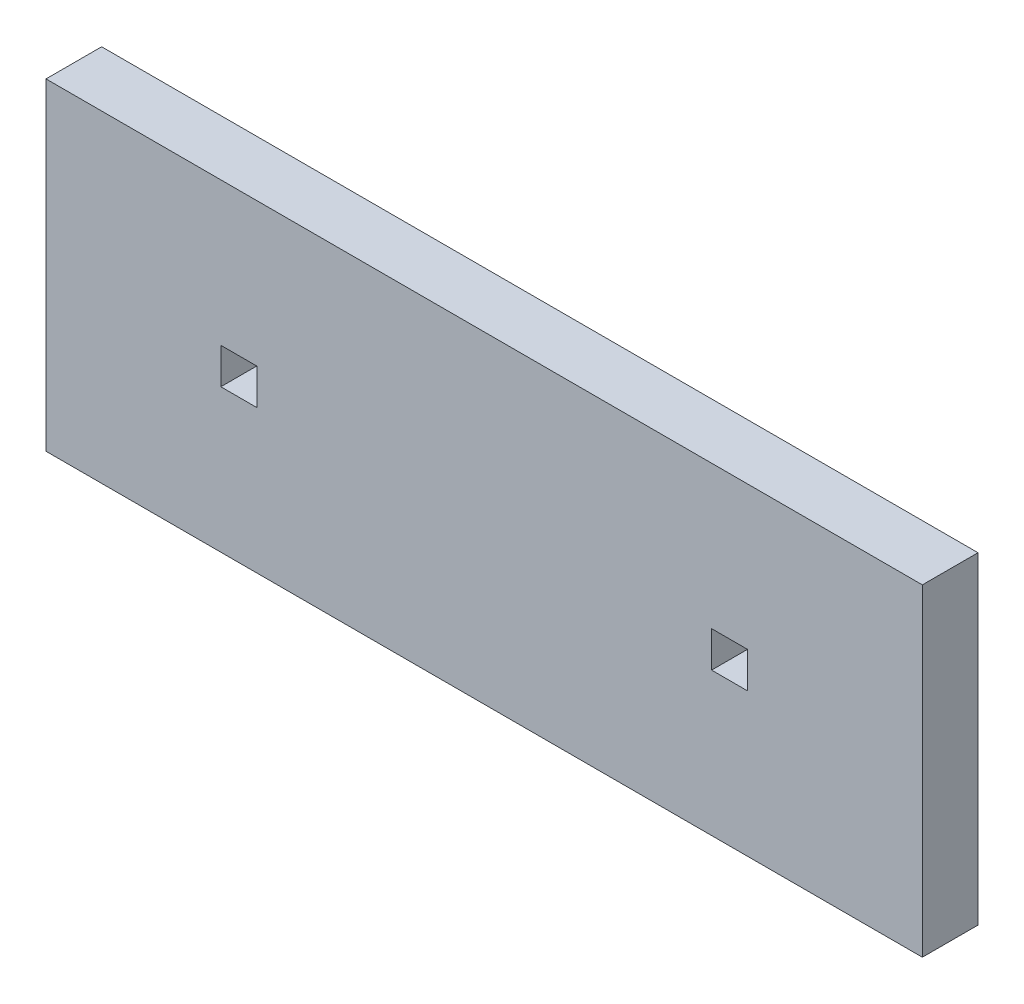
ISO-10303-21;
HEADER;
FILE_DESCRIPTION(('STEP AP214'),'2;1');
FILE_NAME('part.step','',(''),(''),'','','');
FILE_SCHEMA(('AUTOMOTIVE_DESIGN { 1 0 10303 214 1 1 1 1 }'));
ENDSEC;
DATA;
#1=APPLICATION_CONTEXT('core data for automotive mechanical design processes');
#2=APPLICATION_PROTOCOL_DEFINITION('international standard','automotive_design',2000,#1);
#3=PRODUCT_CONTEXT('',#1,'mechanical');
#4=PRODUCT('Part','Part','',(#3));
#5=PRODUCT_RELATED_PRODUCT_CATEGORY('part','',(#4));
#6=PRODUCT_DEFINITION_FORMATION('','',#4);
#7=PRODUCT_DEFINITION_CONTEXT('part definition',#1,'design');
#8=PRODUCT_DEFINITION('design','',#6,#7);
#9=PRODUCT_DEFINITION_SHAPE('','',#8);
#10=(LENGTH_UNIT() NAMED_UNIT(*) SI_UNIT(.MILLI.,.METRE.));
#11=(NAMED_UNIT(*) PLANE_ANGLE_UNIT() SI_UNIT($,.RADIAN.));
#12=(NAMED_UNIT(*) SI_UNIT($,.STERADIAN.) SOLID_ANGLE_UNIT());
#13=UNCERTAINTY_MEASURE_WITH_UNIT(LENGTH_MEASURE(1.E-05),#10,'distance_accuracy_value','');
#14=(GEOMETRIC_REPRESENTATION_CONTEXT(3) GLOBAL_UNCERTAINTY_ASSIGNED_CONTEXT((#13)) GLOBAL_UNIT_ASSIGNED_CONTEXT((#10,
#11,#12)) REPRESENTATION_CONTEXT('',''));
#15=CARTESIAN_POINT('',(0.,0.,0.));
#16=DIRECTION('',(0.,0.,1.));
#17=DIRECTION('',(1.,0.,0.));
#18=AXIS2_PLACEMENT_3D('',#15,#16,#17);
#19=CARTESIAN_POINT('',(0.,-2.61249429999999,3.175));
#20=DIRECTION('',(0.,-1.,0.));
#21=DIRECTION('',(0.,0.,-1.));
#22=AXIS2_PLACEMENT_3D('',#19,#20,#21);
#23=PLANE('',#22);
#24=DIRECTION('',(-1.,0.,0.));
#25=VECTOR('',#24,1.);
#26=CARTESIAN_POINT('',(0.,-2.61249429999999,0.));
#27=LINE('',#26,#25);
#28=CARTESIAN_POINT('',(15.025,-2.61249429999999,0.));
#29=VERTEX_POINT('',#28);
#30=CARTESIAN_POINT('',(12.975,-2.61249429999999,0.));
#31=VERTEX_POINT('',#30);
#32=EDGE_CURVE('E180',#29,#31,#27,.T.);
#33=ORIENTED_EDGE('',*,*,#32,.T.);
#34=DIRECTION('',(0.,0.,-1.));
#35=VECTOR('',#34,1.);
#36=CARTESIAN_POINT('',(12.975,-2.61249429999999,3.175));
#37=LINE('',#36,#35);
#38=CARTESIAN_POINT('',(12.975,-2.61249429999999,3.175));
#39=VERTEX_POINT('',#38);
#40=EDGE_CURVE('E11',#39,#31,#37,.T.);
#41=ORIENTED_EDGE('',*,*,#40,.F.);
#42=DIRECTION('',(-1.,0.,0.));
#43=VECTOR('',#42,1.);
#44=CARTESIAN_POINT('',(0.,-2.61249429999999,3.175));
#45=LINE('',#44,#43);
#46=CARTESIAN_POINT('',(15.025,-2.61249429999999,3.175));
#47=VERTEX_POINT('',#46);
#48=EDGE_CURVE('E139',#47,#39,#45,.T.);
#49=ORIENTED_EDGE('',*,*,#48,.F.);
#50=DIRECTION('',(0.,0.,-1.));
#51=VECTOR('',#50,1.);
#52=CARTESIAN_POINT('',(15.025,-2.61249429999999,3.175));
#53=LINE('',#52,#51);
#54=EDGE_CURVE('E55',#47,#29,#53,.T.);
#55=ORIENTED_EDGE('',*,*,#54,.T.);
#56=EDGE_LOOP('',(#33,#41,#49,#55));
#57=FACE_BOUND('',#56,.T.);
#58=ADVANCED_FACE('F36',(#57),#23,.F.);
#59=CARTESIAN_POINT('',(12.975,0.,3.175));
#60=DIRECTION('',(-1.,0.,0.));
#61=DIRECTION('',(0.,-1.,0.));
#62=AXIS2_PLACEMENT_3D('',#59,#60,#61);
#63=PLANE('',#62);
#64=DIRECTION('',(0.,1.,0.));
#65=VECTOR('',#64,1.);
#66=CARTESIAN_POINT('',(12.975,0.,0.));
#67=LINE('',#66,#65);
#68=CARTESIAN_POINT('',(12.975,-0.562494299999992,0.));
#69=VERTEX_POINT('',#68);
#70=EDGE_CURVE('E145',#31,#69,#67,.T.);
#71=ORIENTED_EDGE('',*,*,#70,.T.);
#72=DIRECTION('',(0.,0.,-1.));
#73=VECTOR('',#72,1.);
#74=CARTESIAN_POINT('',(12.975,-0.562494299999992,3.175));
#75=LINE('',#74,#73);
#76=CARTESIAN_POINT('',(12.975,-0.562494299999992,3.175));
#77=VERTEX_POINT('',#76);
#78=EDGE_CURVE('E46',#77,#69,#75,.T.);
#79=ORIENTED_EDGE('',*,*,#78,.F.);
#80=DIRECTION('',(0.,1.,0.));
#81=VECTOR('',#80,1.);
#82=CARTESIAN_POINT('',(12.975,0.,3.175));
#83=LINE('',#82,#81);
#84=EDGE_CURVE('E133',#39,#77,#83,.T.);
#85=ORIENTED_EDGE('',*,*,#84,.F.);
#86=ORIENTED_EDGE('',*,*,#40,.T.);
#87=EDGE_LOOP('',(#71,#79,#85,#86));
#88=FACE_BOUND('',#87,.T.);
#89=ADVANCED_FACE('F144',(#88),#63,.F.);
#90=CARTESIAN_POINT('',(0.,-0.562494299999991,3.175));
#91=DIRECTION('',(0.,-1.,0.));
#92=DIRECTION('',(1.,0.,0.));
#93=AXIS2_PLACEMENT_3D('',#90,#91,#92);
#94=PLANE('',#93);
#95=DIRECTION('',(-1.,0.,0.));
#96=VECTOR('',#95,1.);
#97=CARTESIAN_POINT('',(0.,-0.562494299999991,0.));
#98=LINE('',#97,#96);
#99=CARTESIAN_POINT('',(15.025,-0.562494299999992,0.));
#100=VERTEX_POINT('',#99);
#101=EDGE_CURVE('E183',#100,#69,#98,.T.);
#102=ORIENTED_EDGE('',*,*,#101,.F.);
#103=DIRECTION('',(0.,0.,-1.));
#104=VECTOR('',#103,1.);
#105=CARTESIAN_POINT('',(15.025,-0.562494299999992,3.175));
#106=LINE('',#105,#104);
#107=CARTESIAN_POINT('',(15.025,-0.562494299999992,3.175));
#108=VERTEX_POINT('',#107);
#109=EDGE_CURVE('E93',#108,#100,#106,.T.);
#110=ORIENTED_EDGE('',*,*,#109,.F.);
#111=DIRECTION('',(-1.,0.,0.));
#112=VECTOR('',#111,1.);
#113=CARTESIAN_POINT('',(0.,-0.562494299999991,3.175));
#114=LINE('',#113,#112);
#115=EDGE_CURVE('E138',#108,#77,#114,.T.);
#116=ORIENTED_EDGE('',*,*,#115,.T.);
#117=ORIENTED_EDGE('',*,*,#78,.T.);
#118=EDGE_LOOP('',(#102,#110,#116,#117));
#119=FACE_BOUND('',#118,.T.);
#120=ADVANCED_FACE('F149',(#119),#94,.T.);
#121=CARTESIAN_POINT('',(0.,-0.562494299999992,3.175));
#122=DIRECTION('',(0.,1.,0.));
#123=DIRECTION('',(0.,0.,1.));
#124=AXIS2_PLACEMENT_3D('',#121,#122,#123);
#125=PLANE('',#124);
#126=DIRECTION('',(1.,0.,0.));
#127=VECTOR('',#126,1.);
#128=CARTESIAN_POINT('',(0.,-0.562494299999992,0.));
#129=LINE('',#128,#127);
#130=CARTESIAN_POINT('',(-15.025,-0.562494299999992,0.));
#131=VERTEX_POINT('',#130);
#132=CARTESIAN_POINT('',(-12.975,-0.562494299999992,0.));
#133=VERTEX_POINT('',#132);
#134=EDGE_CURVE('E168',#131,#133,#129,.T.);
#135=ORIENTED_EDGE('',*,*,#134,.T.);
#136=DIRECTION('',(0.,0.,-1.));
#137=VECTOR('',#136,1.);
#138=CARTESIAN_POINT('',(-12.975,-0.562494299999992,3.175));
#139=LINE('',#138,#137);
#140=CARTESIAN_POINT('',(-12.975,-0.562494299999992,3.175));
#141=VERTEX_POINT('',#140);
#142=EDGE_CURVE('E190',#141,#133,#139,.T.);
#143=ORIENTED_EDGE('',*,*,#142,.F.);
#144=DIRECTION('',(1.,0.,0.));
#145=VECTOR('',#144,1.);
#146=CARTESIAN_POINT('',(0.,-0.562494299999992,3.175));
#147=LINE('',#146,#145);
#148=CARTESIAN_POINT('',(-15.025,-0.562494299999992,3.175));
#149=VERTEX_POINT('',#148);
#150=EDGE_CURVE('E225',#149,#141,#147,.T.);
#151=ORIENTED_EDGE('',*,*,#150,.F.);
#152=DIRECTION('',(0.,0.,-1.));
#153=VECTOR('',#152,1.);
#154=CARTESIAN_POINT('',(-15.025,-0.562494299999992,3.175));
#155=LINE('',#154,#153);
#156=EDGE_CURVE('E192',#149,#131,#155,.T.);
#157=ORIENTED_EDGE('',*,*,#156,.T.);
#158=EDGE_LOOP('',(#135,#143,#151,#157));
#159=FACE_BOUND('',#158,.T.);
#160=ADVANCED_FACE('F255',(#159),#125,.F.);
#161=CARTESIAN_POINT('',(-12.975,0.,3.175));
#162=DIRECTION('',(1.,0.,0.));
#163=DIRECTION('',(0.,1.,0.));
#164=AXIS2_PLACEMENT_3D('',#161,#162,#163);
#165=PLANE('',#164);
#166=DIRECTION('',(0.,-1.,0.));
#167=VECTOR('',#166,1.);
#168=CARTESIAN_POINT('',(-12.975,0.,0.));
#169=LINE('',#168,#167);
#170=CARTESIAN_POINT('',(-12.975,-2.61249429999999,0.));
#171=VERTEX_POINT('',#170);
#172=EDGE_CURVE('E171',#133,#171,#169,.T.);
#173=ORIENTED_EDGE('',*,*,#172,.T.);
#174=DIRECTION('',(0.,0.,-1.));
#175=VECTOR('',#174,1.);
#176=CARTESIAN_POINT('',(-12.975,-2.61249429999999,3.175));
#177=LINE('',#176,#175);
#178=CARTESIAN_POINT('',(-12.975,-2.61249429999999,3.175));
#179=VERTEX_POINT('',#178);
#180=EDGE_CURVE('E196',#179,#171,#177,.T.);
#181=ORIENTED_EDGE('',*,*,#180,.F.);
#182=DIRECTION('',(0.,-1.,0.));
#183=VECTOR('',#182,1.);
#184=CARTESIAN_POINT('',(-12.975,0.,3.175));
#185=LINE('',#184,#183);
#186=EDGE_CURVE('E234',#141,#179,#185,.T.);
#187=ORIENTED_EDGE('',*,*,#186,.F.);
#188=ORIENTED_EDGE('',*,*,#142,.T.);
#189=EDGE_LOOP('',(#173,#181,#187,#188));
#190=FACE_BOUND('',#189,.T.);
#191=ADVANCED_FACE('F257',(#190),#165,.F.);
#192=CARTESIAN_POINT('',(0.,-2.61249429999999,3.175));
#193=DIRECTION('',(0.,1.,0.));
#194=DIRECTION('',(0.,0.,1.));
#195=AXIS2_PLACEMENT_3D('',#192,#193,#194);
#196=PLANE('',#195);
#197=DIRECTION('',(1.,0.,0.));
#198=VECTOR('',#197,1.);
#199=CARTESIAN_POINT('',(0.,-2.61249429999999,0.));
#200=LINE('',#199,#198);
#201=CARTESIAN_POINT('',(-15.025,-2.61249429999999,0.));
#202=VERTEX_POINT('',#201);
#203=EDGE_CURVE('E174',#202,#171,#200,.T.);
#204=ORIENTED_EDGE('',*,*,#203,.F.);
#205=DIRECTION('',(0.,0.,-1.));
#206=VECTOR('',#205,1.);
#207=CARTESIAN_POINT('',(-15.025,-2.61249429999999,3.175));
#208=LINE('',#207,#206);
#209=CARTESIAN_POINT('',(-15.025,-2.61249429999999,3.175));
#210=VERTEX_POINT('',#209);
#211=EDGE_CURVE('E194',#210,#202,#208,.T.);
#212=ORIENTED_EDGE('',*,*,#211,.F.);
#213=DIRECTION('',(1.,0.,0.));
#214=VECTOR('',#213,1.);
#215=CARTESIAN_POINT('',(0.,-2.61249429999999,3.175));
#216=LINE('',#215,#214);
#217=EDGE_CURVE('E236',#210,#179,#216,.T.);
#218=ORIENTED_EDGE('',*,*,#217,.T.);
#219=ORIENTED_EDGE('',*,*,#180,.T.);
#220=EDGE_LOOP('',(#204,#212,#218,#219));
#221=FACE_BOUND('',#220,.T.);
#222=ADVANCED_FACE('F251',(#221),#196,.T.);
#223=CARTESIAN_POINT('',(0.,7.6124943,3.175));
#224=DIRECTION('',(0.,1.,0.));
#225=DIRECTION('',(0.,0.,1.));
#226=AXIS2_PLACEMENT_3D('',#223,#224,#225);
#227=PLANE('',#226);
#228=DIRECTION('',(1.,0.,0.));
#229=VECTOR('',#228,1.);
#230=CARTESIAN_POINT('',(0.,7.6124943,0.));
#231=LINE('',#230,#229);
#232=CARTESIAN_POINT('',(-25.,7.6124943,0.));
#233=VERTEX_POINT('',#232);
#234=CARTESIAN_POINT('',(25.,7.6124943,0.));
#235=VERTEX_POINT('',#234);
#236=EDGE_CURVE('E156',#233,#235,#231,.T.);
#237=ORIENTED_EDGE('',*,*,#236,.F.);
#238=DIRECTION('',(0.,0.,-1.));
#239=VECTOR('',#238,1.);
#240=CARTESIAN_POINT('',(-25.,7.6124943,3.175));
#241=LINE('',#240,#239);
#242=CARTESIAN_POINT('',(-25.,7.6124943,3.175));
#243=VERTEX_POINT('',#242);
#244=EDGE_CURVE('E40',#243,#233,#241,.T.);
#245=ORIENTED_EDGE('',*,*,#244,.F.);
#246=DIRECTION('',(1.,0.,0.));
#247=VECTOR('',#246,1.);
#248=CARTESIAN_POINT('',(0.,7.6124943,3.175));
#249=LINE('',#248,#247);
#250=CARTESIAN_POINT('',(25.,7.6124943,3.175));
#251=VERTEX_POINT('',#250);
#252=EDGE_CURVE('E188',#243,#251,#249,.T.);
#253=ORIENTED_EDGE('',*,*,#252,.T.);
#254=DIRECTION('',(0.,0.,-1.));
#255=VECTOR('',#254,1.);
#256=CARTESIAN_POINT('',(25.,7.6124943,3.175));
#257=LINE('',#256,#255);
#258=EDGE_CURVE('E152',#251,#235,#257,.T.);
#259=ORIENTED_EDGE('',*,*,#258,.T.);
#260=EDGE_LOOP('',(#237,#245,#253,#259));
#261=FACE_BOUND('',#260,.T.);
#262=ADVANCED_FACE('F38',(#261),#227,.T.);
#263=CARTESIAN_POINT('',(-25.,0.,3.175));
#264=DIRECTION('',(-1.,0.,0.));
#265=DIRECTION('',(0.,0.,1.));
#266=AXIS2_PLACEMENT_3D('',#263,#264,#265);
#267=PLANE('',#266);
#268=DIRECTION('',(0.,1.,0.));
#269=VECTOR('',#268,1.);
#270=CARTESIAN_POINT('',(-25.,0.,0.));
#271=LINE('',#270,#269);
#272=CARTESIAN_POINT('',(-25.,-10.7874943,0.));
#273=VERTEX_POINT('',#272);
#274=EDGE_CURVE('E159',#273,#233,#271,.T.);
#275=ORIENTED_EDGE('',*,*,#274,.F.);
#276=DIRECTION('',(0.,0.,-1.));
#277=VECTOR('',#276,1.);
#278=CARTESIAN_POINT('',(-25.,-10.7874943,3.175));
#279=LINE('',#278,#277);
#280=CARTESIAN_POINT('',(-25.,-10.7874943,3.175));
#281=VERTEX_POINT('',#280);
#282=EDGE_CURVE('E202',#281,#273,#279,.T.);
#283=ORIENTED_EDGE('',*,*,#282,.F.);
#284=DIRECTION('',(0.,1.,0.));
#285=VECTOR('',#284,1.);
#286=CARTESIAN_POINT('',(-25.,0.,3.175));
#287=LINE('',#286,#285);
#288=EDGE_CURVE('E211',#281,#243,#287,.T.);
#289=ORIENTED_EDGE('',*,*,#288,.T.);
#290=ORIENTED_EDGE('',*,*,#244,.T.);
#291=EDGE_LOOP('',(#275,#283,#289,#290));
#292=FACE_BOUND('',#291,.T.);
#293=ADVANCED_FACE('F209',(#292),#267,.T.);
#294=CARTESIAN_POINT('',(0.,-10.7874943,3.175));
#295=DIRECTION('',(0.,-1.,0.));
#296=DIRECTION('',(0.,0.,-1.));
#297=AXIS2_PLACEMENT_3D('',#294,#295,#296);
#298=PLANE('',#297);
#299=DIRECTION('',(-1.,0.,0.));
#300=VECTOR('',#299,1.);
#301=CARTESIAN_POINT('',(0.,-10.7874943,0.));
#302=LINE('',#301,#300);
#303=CARTESIAN_POINT('',(25.,-10.7874943,0.));
#304=VERTEX_POINT('',#303);
#305=EDGE_CURVE('E162',#304,#273,#302,.T.);
#306=ORIENTED_EDGE('',*,*,#305,.F.);
#307=DIRECTION('',(0.,0.,-1.));
#308=VECTOR('',#307,1.);
#309=CARTESIAN_POINT('',(25.,-10.7874943,3.175));
#310=LINE('',#309,#308);
#311=CARTESIAN_POINT('',(25.,-10.7874943,3.175));
#312=VERTEX_POINT('',#311);
#313=EDGE_CURVE('E201',#312,#304,#310,.T.);
#314=ORIENTED_EDGE('',*,*,#313,.F.);
#315=DIRECTION('',(-1.,0.,0.));
#316=VECTOR('',#315,1.);
#317=CARTESIAN_POINT('',(0.,-10.7874943,3.175));
#318=LINE('',#317,#316);
#319=EDGE_CURVE('E220',#312,#281,#318,.T.);
#320=ORIENTED_EDGE('',*,*,#319,.T.);
#321=ORIENTED_EDGE('',*,*,#282,.T.);
#322=EDGE_LOOP('',(#306,#314,#320,#321));
#323=FACE_BOUND('',#322,.T.);
#324=ADVANCED_FACE('F217',(#323),#298,.T.);
#325=CARTESIAN_POINT('',(-15.025,0.,3.175));
#326=DIRECTION('',(1.,0.,0.));
#327=DIRECTION('',(0.,0.,-1.));
#328=AXIS2_PLACEMENT_3D('',#325,#326,#327);
#329=PLANE('',#328);
#330=DIRECTION('',(0.,-1.,0.));
#331=VECTOR('',#330,1.);
#332=CARTESIAN_POINT('',(-15.025,0.,0.));
#333=LINE('',#332,#331);
#334=EDGE_CURVE('E177',#131,#202,#333,.T.);
#335=ORIENTED_EDGE('',*,*,#334,.F.);
#336=ORIENTED_EDGE('',*,*,#156,.F.);
#337=DIRECTION('',(0.,-1.,0.));
#338=VECTOR('',#337,1.);
#339=CARTESIAN_POINT('',(-15.025,0.,3.175));
#340=LINE('',#339,#338);
#341=EDGE_CURVE('E239',#149,#210,#340,.T.);
#342=ORIENTED_EDGE('',*,*,#341,.T.);
#343=ORIENTED_EDGE('',*,*,#211,.T.);
#344=EDGE_LOOP('',(#335,#336,#342,#343));
#345=FACE_BOUND('',#344,.T.);
#346=ADVANCED_FACE('F244',(#345),#329,.T.);
#347=CARTESIAN_POINT('',(25.,0.,3.175));
#348=DIRECTION('',(-1.,0.,0.));
#349=DIRECTION('',(0.,0.,1.));
#350=AXIS2_PLACEMENT_3D('',#347,#348,#349);
#351=PLANE('',#350);
#352=DIRECTION('',(0.,1.,0.));
#353=VECTOR('',#352,1.);
#354=CARTESIAN_POINT('',(25.,0.,0.));
#355=LINE('',#354,#353);
#356=EDGE_CURVE('E165',#304,#235,#355,.T.);
#357=ORIENTED_EDGE('',*,*,#356,.T.);
#358=ORIENTED_EDGE('',*,*,#258,.F.);
#359=DIRECTION('',(0.,1.,0.));
#360=VECTOR('',#359,1.);
#361=CARTESIAN_POINT('',(25.,0.,3.175));
#362=LINE('',#361,#360);
#363=EDGE_CURVE('E222',#312,#251,#362,.T.);
#364=ORIENTED_EDGE('',*,*,#363,.F.);
#365=ORIENTED_EDGE('',*,*,#313,.T.);
#366=EDGE_LOOP('',(#357,#358,#364,#365));
#367=FACE_BOUND('',#366,.T.);
#368=ADVANCED_FACE('F223',(#367),#351,.F.);
#369=CARTESIAN_POINT('',(15.025,0.,3.175));
#370=DIRECTION('',(-1.,0.,0.));
#371=DIRECTION('',(0.,0.,1.));
#372=AXIS2_PLACEMENT_3D('',#369,#370,#371);
#373=PLANE('',#372);
#374=DIRECTION('',(0.,1.,0.));
#375=VECTOR('',#374,1.);
#376=CARTESIAN_POINT('',(15.025,0.,0.));
#377=LINE('',#376,#375);
#378=EDGE_CURVE('E185',#29,#100,#377,.T.);
#379=ORIENTED_EDGE('',*,*,#378,.F.);
#380=ORIENTED_EDGE('',*,*,#54,.F.);
#381=DIRECTION('',(0.,1.,0.));
#382=VECTOR('',#381,1.);
#383=CARTESIAN_POINT('',(15.025,0.,3.175));
#384=LINE('',#383,#382);
#385=EDGE_CURVE('E150',#47,#108,#384,.T.);
#386=ORIENTED_EDGE('',*,*,#385,.T.);
#387=ORIENTED_EDGE('',*,*,#109,.T.);
#388=EDGE_LOOP('',(#379,#380,#386,#387));
#389=FACE_BOUND('',#388,.T.);
#390=ADVANCED_FACE('F279',(#389),#373,.T.);
#391=CARTESIAN_POINT('',(0.,0.,3.175));
#392=DIRECTION('',(0.,0.,1.));
#393=DIRECTION('',(1.,0.,0.));
#394=AXIS2_PLACEMENT_3D('',#391,#392,#393);
#395=PLANE('',#394);
#396=ORIENTED_EDGE('',*,*,#252,.F.);
#397=ORIENTED_EDGE('',*,*,#288,.F.);
#398=ORIENTED_EDGE('',*,*,#319,.F.);
#399=ORIENTED_EDGE('',*,*,#363,.T.);
#400=EDGE_LOOP('',(#396,#397,#398,#399));
#401=FACE_BOUND('',#400,.T.);
#402=ORIENTED_EDGE('',*,*,#150,.T.);
#403=ORIENTED_EDGE('',*,*,#186,.T.);
#404=ORIENTED_EDGE('',*,*,#217,.F.);
#405=ORIENTED_EDGE('',*,*,#341,.F.);
#406=EDGE_LOOP('',(#402,#403,#404,#405));
#407=FACE_BOUND('',#406,.T.);
#408=ORIENTED_EDGE('',*,*,#48,.T.);
#409=ORIENTED_EDGE('',*,*,#84,.T.);
#410=ORIENTED_EDGE('',*,*,#115,.F.);
#411=ORIENTED_EDGE('',*,*,#385,.F.);
#412=EDGE_LOOP('',(#408,#409,#410,#411));
#413=FACE_BOUND('',#412,.T.);
#414=ADVANCED_FACE('F135',(#401,#407,#413),#395,.T.);
#415=CARTESIAN_POINT('',(0.,0.,0.));
#416=DIRECTION('',(0.,0.,1.));
#417=DIRECTION('',(1.,0.,0.));
#418=AXIS2_PLACEMENT_3D('',#415,#416,#417);
#419=PLANE('',#418);
#420=ORIENTED_EDGE('',*,*,#236,.T.);
#421=ORIENTED_EDGE('',*,*,#356,.F.);
#422=ORIENTED_EDGE('',*,*,#305,.T.);
#423=ORIENTED_EDGE('',*,*,#274,.T.);
#424=EDGE_LOOP('',(#420,#421,#422,#423));
#425=FACE_BOUND('',#424,.T.);
#426=ORIENTED_EDGE('',*,*,#134,.F.);
#427=ORIENTED_EDGE('',*,*,#334,.T.);
#428=ORIENTED_EDGE('',*,*,#203,.T.);
#429=ORIENTED_EDGE('',*,*,#172,.F.);
#430=EDGE_LOOP('',(#426,#427,#428,#429));
#431=FACE_BOUND('',#430,.T.);
#432=ORIENTED_EDGE('',*,*,#32,.F.);
#433=ORIENTED_EDGE('',*,*,#378,.T.);
#434=ORIENTED_EDGE('',*,*,#101,.T.);
#435=ORIENTED_EDGE('',*,*,#70,.F.);
#436=EDGE_LOOP('',(#432,#433,#434,#435));
#437=FACE_BOUND('',#436,.T.);
#438=ADVANCED_FACE('F215',(#425,#431,#437),#419,.F.);
#439=CLOSED_SHELL('',(#58,#89,#120,#160,#191,#222,#262,#293,#324,#346,#368,#390,#414,#438));
#440=MANIFOLD_SOLID_BREP('B2',#439);
#441=ADVANCED_BREP_SHAPE_REPRESENTATION('',(#18,#440),#14);
#442=SHAPE_DEFINITION_REPRESENTATION(#9,#441);
ENDSEC;
END-ISO-10303-21;
